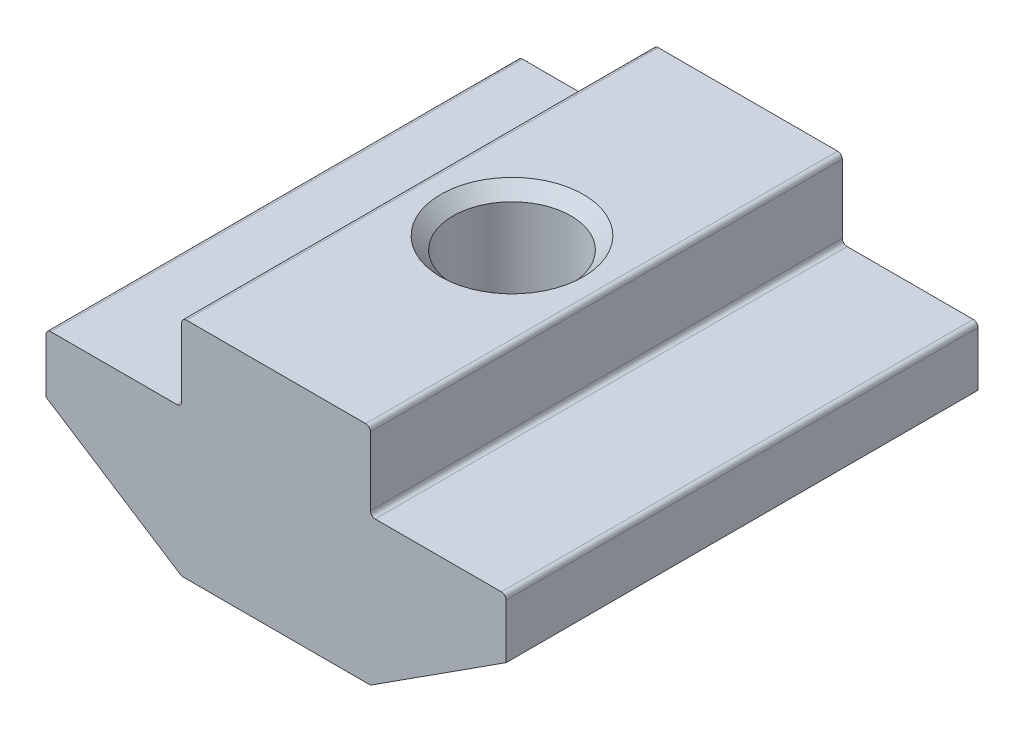
ISO-10303-21;
HEADER;
FILE_DESCRIPTION(('STEP AP214'),'2;1');
FILE_NAME('part.step','',(''),(''),'','','');
FILE_SCHEMA(('AUTOMOTIVE_DESIGN { 1 0 10303 214 1 1 1 1 }'));
ENDSEC;
DATA;
#1=APPLICATION_CONTEXT('core data for automotive mechanical design processes');
#2=APPLICATION_PROTOCOL_DEFINITION('international standard','automotive_design',2000,#1);
#3=PRODUCT_CONTEXT('',#1,'mechanical');
#4=PRODUCT('Part','Part','',(#3));
#5=PRODUCT_RELATED_PRODUCT_CATEGORY('part','',(#4));
#6=PRODUCT_DEFINITION_FORMATION('','',#4);
#7=PRODUCT_DEFINITION_CONTEXT('part definition',#1,'design');
#8=PRODUCT_DEFINITION('design','',#6,#7);
#9=PRODUCT_DEFINITION_SHAPE('','',#8);
#10=(LENGTH_UNIT() NAMED_UNIT(*) SI_UNIT(.MILLI.,.METRE.));
#11=(NAMED_UNIT(*) PLANE_ANGLE_UNIT() SI_UNIT($,.RADIAN.));
#12=(NAMED_UNIT(*) SI_UNIT($,.STERADIAN.) SOLID_ANGLE_UNIT());
#13=UNCERTAINTY_MEASURE_WITH_UNIT(LENGTH_MEASURE(1.E-05),#10,'distance_accuracy_value','');
#14=(GEOMETRIC_REPRESENTATION_CONTEXT(3) GLOBAL_UNCERTAINTY_ASSIGNED_CONTEXT((#13)) GLOBAL_UNIT_ASSIGNED_CONTEXT((#10,
#11,#12)) REPRESENTATION_CONTEXT('',''));
#15=CARTESIAN_POINT('',(0.,0.,0.));
#16=DIRECTION('',(0.,0.,1.));
#17=DIRECTION('',(1.,0.,0.));
#18=AXIS2_PLACEMENT_3D('',#15,#16,#17);
#19=CARTESIAN_POINT('',(-4.,0.,10.));
#20=DIRECTION('',(1.,0.,0.));
#21=DIRECTION('',(0.,0.,-1.));
#22=AXIS2_PLACEMENT_3D('',#19,#20,#21);
#23=PLANE('',#22);
#24=DIRECTION('',(0.,-1.,0.));
#25=VECTOR('',#24,1.);
#26=CARTESIAN_POINT('',(-4.,0.,10.));
#27=LINE('',#26,#25);
#28=CARTESIAN_POINT('',(-4.,-0.200000000000002,10.));
#29=VERTEX_POINT('',#28);
#30=CARTESIAN_POINT('',(-4.,-3.1,10.));
#31=VERTEX_POINT('',#30);
#32=EDGE_CURVE('E234',#29,#31,#27,.T.);
#33=ORIENTED_EDGE('',*,*,#32,.F.);
#34=DIRECTION('',(0.,0.,-1.));
#35=VECTOR('',#34,1.);
#36=CARTESIAN_POINT('',(-4.,-0.200000000000002,10.));
#37=LINE('',#36,#35);
#38=CARTESIAN_POINT('',(-4.,-0.200000000000002,-10.));
#39=VERTEX_POINT('',#38);
#40=EDGE_CURVE('E285',#29,#39,#37,.T.);
#41=ORIENTED_EDGE('',*,*,#40,.T.);
#42=DIRECTION('',(0.,-1.,0.));
#43=VECTOR('',#42,1.);
#44=CARTESIAN_POINT('',(-4.,0.,-10.));
#45=LINE('',#44,#43);
#46=CARTESIAN_POINT('',(-4.,-3.1,-10.));
#47=VERTEX_POINT('',#46);
#48=EDGE_CURVE('E208',#39,#47,#45,.T.);
#49=ORIENTED_EDGE('',*,*,#48,.T.);
#50=DIRECTION('',(0.,0.,-1.));
#51=VECTOR('',#50,1.);
#52=CARTESIAN_POINT('',(-4.,-3.1,10.));
#53=LINE('',#52,#51);
#54=EDGE_CURVE('E283',#47,#31,#53,.F.);
#55=ORIENTED_EDGE('',*,*,#54,.T.);
#56=EDGE_LOOP('',(#33,#41,#49,#55));
#57=FACE_BOUND('',#56,.T.);
#58=ADVANCED_FACE('F37',(#57),#23,.F.);
#59=CARTESIAN_POINT('',(-4.,-3.3,10.));
#60=DIRECTION('',(0.,-1.,0.));
#61=DIRECTION('',(1.,0.,0.));
#62=AXIS2_PLACEMENT_3D('',#59,#60,#61);
#63=PLANE('',#62);
#64=DIRECTION('',(-1.,0.,0.));
#65=VECTOR('',#64,1.);
#66=CARTESIAN_POINT('',(-4.,-3.3,-10.));
#67=LINE('',#66,#65);
#68=CARTESIAN_POINT('',(-4.2,-3.3,-10.));
#69=VERTEX_POINT('',#68);
#70=CARTESIAN_POINT('',(-9.55,-3.3,-10.));
#71=VERTEX_POINT('',#70);
#72=EDGE_CURVE('E211',#69,#71,#67,.T.);
#73=ORIENTED_EDGE('',*,*,#72,.T.);
#74=DIRECTION('',(0.,0.,-1.));
#75=VECTOR('',#74,1.);
#76=CARTESIAN_POINT('',(-9.55,-3.3,10.));
#77=LINE('',#76,#75);
#78=CARTESIAN_POINT('',(-9.55,-3.3,10.));
#79=VERTEX_POINT('',#78);
#80=EDGE_CURVE('E293',#71,#79,#77,.F.);
#81=ORIENTED_EDGE('',*,*,#80,.T.);
#82=DIRECTION('',(-1.,0.,0.));
#83=VECTOR('',#82,1.);
#84=CARTESIAN_POINT('',(-4.,-3.3,10.));
#85=LINE('',#84,#83);
#86=CARTESIAN_POINT('',(-4.2,-3.3,10.));
#87=VERTEX_POINT('',#86);
#88=EDGE_CURVE('E175',#87,#79,#85,.T.);
#89=ORIENTED_EDGE('',*,*,#88,.F.);
#90=DIRECTION('',(0.,0.,-1.));
#91=VECTOR('',#90,1.);
#92=CARTESIAN_POINT('',(-4.2,-3.3,-10.));
#93=LINE('',#92,#91);
#94=EDGE_CURVE('E290',#87,#69,#93,.T.);
#95=ORIENTED_EDGE('',*,*,#94,.T.);
#96=EDGE_LOOP('',(#73,#81,#89,#95));
#97=FACE_BOUND('',#96,.T.);
#98=ADVANCED_FACE('F313',(#97),#63,.F.);
#99=CARTESIAN_POINT('',(-9.75,-3.3,10.));
#100=DIRECTION('',(1.,0.,0.));
#101=DIRECTION('',(0.,0.,-1.));
#102=AXIS2_PLACEMENT_3D('',#99,#100,#101);
#103=PLANE('',#102);
#104=DIRECTION('',(0.,-1.,0.));
#105=VECTOR('',#104,1.);
#106=CARTESIAN_POINT('',(-9.75,-3.3,10.));
#107=LINE('',#106,#105);
#108=CARTESIAN_POINT('',(-9.75,-3.5,10.));
#109=VERTEX_POINT('',#108);
#110=CARTESIAN_POINT('',(-9.75,-5.8,10.));
#111=VERTEX_POINT('',#110);
#112=EDGE_CURVE('E162',#109,#111,#107,.T.);
#113=ORIENTED_EDGE('',*,*,#112,.F.);
#114=DIRECTION('',(0.,0.,-1.));
#115=VECTOR('',#114,1.);
#116=CARTESIAN_POINT('',(-9.75,-3.5,10.));
#117=LINE('',#116,#115);
#118=CARTESIAN_POINT('',(-9.75,-3.5,-10.));
#119=VERTEX_POINT('',#118);
#120=EDGE_CURVE('E288',#109,#119,#117,.T.);
#121=ORIENTED_EDGE('',*,*,#120,.T.);
#122=DIRECTION('',(0.,-1.,0.));
#123=VECTOR('',#122,1.);
#124=CARTESIAN_POINT('',(-9.75,-3.3,-10.));
#125=LINE('',#124,#123);
#126=CARTESIAN_POINT('',(-9.75,-5.8,-10.));
#127=VERTEX_POINT('',#126);
#128=EDGE_CURVE('E181',#119,#127,#125,.T.);
#129=ORIENTED_EDGE('',*,*,#128,.T.);
#130=DIRECTION('',(0.,0.,-1.));
#131=VECTOR('',#130,1.);
#132=CARTESIAN_POINT('',(-9.75,-5.8,10.));
#133=LINE('',#132,#131);
#134=EDGE_CURVE('E178',#111,#127,#133,.T.);
#135=ORIENTED_EDGE('',*,*,#134,.F.);
#136=EDGE_LOOP('',(#113,#121,#129,#135));
#137=FACE_BOUND('',#136,.T.);
#138=ADVANCED_FACE('F179',(#137),#103,.F.);
#139=CARTESIAN_POINT('',(-9.75,-5.8,10.));
#140=DIRECTION('',(0.541127125407786,0.840940802998586,0.));
#141=DIRECTION('',(-0.840940802998586,0.541127125407786,0.));
#142=AXIS2_PLACEMENT_3D('',#139,#140,#141);
#143=PLANE('',#142);
#144=DIRECTION('',(0.840940802998586,-0.541127125407786,0.));
#145=VECTOR('',#144,1.);
#146=CARTESIAN_POINT('',(-9.75,-5.8,-10.));
#147=LINE('',#146,#145);
#148=CARTESIAN_POINT('',(-4.04943731798692,-9.46818816059972,-10.));
#149=VERTEX_POINT('',#148);
#150=EDGE_CURVE('E216',#127,#149,#147,.T.);
#151=ORIENTED_EDGE('',*,*,#150,.T.);
#152=DIRECTION('',(0.,0.,-1.));
#153=VECTOR('',#152,1.);
#154=CARTESIAN_POINT('',(-4.04943731798692,-9.46818816059972,10.));
#155=LINE('',#154,#153);
#156=CARTESIAN_POINT('',(-4.04943731798692,-9.46818816059972,10.));
#157=VERTEX_POINT('',#156);
#158=EDGE_CURVE('E190',#149,#157,#155,.F.);
#159=ORIENTED_EDGE('',*,*,#158,.T.);
#160=DIRECTION('',(0.840940802998586,-0.541127125407786,0.));
#161=VECTOR('',#160,1.);
#162=CARTESIAN_POINT('',(-9.75,-5.8,10.));
#163=LINE('',#162,#161);
#164=EDGE_CURVE('E167',#111,#157,#163,.T.);
#165=ORIENTED_EDGE('',*,*,#164,.F.);
#166=ORIENTED_EDGE('',*,*,#134,.T.);
#167=EDGE_LOOP('',(#151,#159,#165,#166));
#168=FACE_BOUND('',#167,.T.);
#169=ADVANCED_FACE('F188',(#168),#143,.F.);
#170=CARTESIAN_POINT('',(-4.,-9.5,10.));
#171=DIRECTION('',(0.,1.,0.));
#172=DIRECTION('',(0.,0.,1.));
#173=AXIS2_PLACEMENT_3D('',#170,#171,#172);
#174=PLANE('',#173);
#175=CARTESIAN_POINT('',(0.,-9.5,0.));
#176=DIRECTION('',(0.,1.,0.));
#177=DIRECTION('',(0.,0.,1.));
#178=AXIS2_PLACEMENT_3D('',#175,#176,#177);
#179=CIRCLE('',#178,3.025);
#180=CARTESIAN_POINT('',(0.,-9.5,3.025));
#181=VERTEX_POINT('',#180);
#182=EDGE_CURVE('E325',#181,#181,#179,.T.);
#183=ORIENTED_EDGE('',*,*,#182,.T.);
#184=EDGE_LOOP('',(#183));
#185=FACE_BOUND('',#184,.T.);
#186=DIRECTION('',(1.,0.,0.));
#187=VECTOR('',#186,1.);
#188=CARTESIAN_POINT('',(-4.,-9.5,-10.));
#189=LINE('',#188,#187);
#190=CARTESIAN_POINT('',(-3.94121189290537,-9.5,-10.));
#191=VERTEX_POINT('',#190);
#192=CARTESIAN_POINT('',(3.94121189290537,-9.5,-10.));
#193=VERTEX_POINT('',#192);
#194=EDGE_CURVE('E218',#191,#193,#189,.T.);
#195=ORIENTED_EDGE('',*,*,#194,.T.);
#196=DIRECTION('',(0.,0.,-1.));
#197=VECTOR('',#196,1.);
#198=CARTESIAN_POINT('',(3.94121189290537,-9.5,10.));
#199=LINE('',#198,#197);
#200=CARTESIAN_POINT('',(3.94121189290537,-9.5,10.));
#201=VERTEX_POINT('',#200);
#202=EDGE_CURVE('E254',#193,#201,#199,.F.);
#203=ORIENTED_EDGE('',*,*,#202,.T.);
#204=DIRECTION('',(1.,0.,0.));
#205=VECTOR('',#204,1.);
#206=CARTESIAN_POINT('',(-4.,-9.5,10.));
#207=LINE('',#206,#205);
#208=CARTESIAN_POINT('',(-3.94121189290537,-9.5,10.));
#209=VERTEX_POINT('',#208);
#210=EDGE_CURVE('E191',#209,#201,#207,.T.);
#211=ORIENTED_EDGE('',*,*,#210,.F.);
#212=DIRECTION('',(0.,0.,-1.));
#213=VECTOR('',#212,1.);
#214=CARTESIAN_POINT('',(-3.94121189290537,-9.5,10.));
#215=LINE('',#214,#213);
#216=EDGE_CURVE('E251',#209,#191,#215,.T.);
#217=ORIENTED_EDGE('',*,*,#216,.T.);
#218=EDGE_LOOP('',(#195,#203,#211,#217));
#219=FACE_BOUND('',#218,.T.);
#220=ADVANCED_FACE('F329',(#185,#219),#174,.F.);
#221=CARTESIAN_POINT('',(9.75,-5.8,10.));
#222=DIRECTION('',(-0.541127125407786,0.840940802998586,0.));
#223=DIRECTION('',(-0.840940802998586,-0.541127125407786,0.));
#224=AXIS2_PLACEMENT_3D('',#221,#222,#223);
#225=PLANE('',#224);
#226=DIRECTION('',(0.840940802998586,0.541127125407786,0.));
#227=VECTOR('',#226,1.);
#228=CARTESIAN_POINT('',(9.75,-5.8,10.));
#229=LINE('',#228,#227);
#230=CARTESIAN_POINT('',(4.04943731798692,-9.46818816059972,10.));
#231=VERTEX_POINT('',#230);
#232=CARTESIAN_POINT('',(9.75,-5.8,10.));
#233=VERTEX_POINT('',#232);
#234=EDGE_CURVE('E193',#231,#233,#229,.T.);
#235=ORIENTED_EDGE('',*,*,#234,.F.);
#236=DIRECTION('',(0.,0.,-1.));
#237=VECTOR('',#236,1.);
#238=CARTESIAN_POINT('',(4.04943731798692,-9.46818816059972,10.));
#239=LINE('',#238,#237);
#240=CARTESIAN_POINT('',(4.04943731798692,-9.46818816059972,-10.));
#241=VERTEX_POINT('',#240);
#242=EDGE_CURVE('E185',#231,#241,#239,.T.);
#243=ORIENTED_EDGE('',*,*,#242,.T.);
#244=DIRECTION('',(0.840940802998586,0.541127125407786,0.));
#245=VECTOR('',#244,1.);
#246=CARTESIAN_POINT('',(9.75,-5.8,-10.));
#247=LINE('',#246,#245);
#248=CARTESIAN_POINT('',(9.75,-5.8,-10.));
#249=VERTEX_POINT('',#248);
#250=EDGE_CURVE('E221',#241,#249,#247,.T.);
#251=ORIENTED_EDGE('',*,*,#250,.T.);
#252=DIRECTION('',(0.,0.,-1.));
#253=VECTOR('',#252,1.);
#254=CARTESIAN_POINT('',(9.75,-5.8,10.));
#255=LINE('',#254,#253);
#256=EDGE_CURVE('E186',#233,#249,#255,.T.);
#257=ORIENTED_EDGE('',*,*,#256,.F.);
#258=EDGE_LOOP('',(#235,#243,#251,#257));
#259=FACE_BOUND('',#258,.T.);
#260=ADVANCED_FACE('F385',(#259),#225,.F.);
#261=CARTESIAN_POINT('',(9.75,-3.3,10.));
#262=DIRECTION('',(-1.,0.,0.));
#263=DIRECTION('',(0.,0.,1.));
#264=AXIS2_PLACEMENT_3D('',#261,#262,#263);
#265=PLANE('',#264);
#266=DIRECTION('',(0.,1.,0.));
#267=VECTOR('',#266,1.);
#268=CARTESIAN_POINT('',(9.75,-3.3,-10.));
#269=LINE('',#268,#267);
#270=CARTESIAN_POINT('',(9.75,-3.5,-10.));
#271=VERTEX_POINT('',#270);
#272=EDGE_CURVE('E223',#249,#271,#269,.T.);
#273=ORIENTED_EDGE('',*,*,#272,.T.);
#274=DIRECTION('',(0.,0.,-1.));
#275=VECTOR('',#274,1.);
#276=CARTESIAN_POINT('',(9.75,-3.5,10.));
#277=LINE('',#276,#275);
#278=CARTESIAN_POINT('',(9.75,-3.5,10.));
#279=VERTEX_POINT('',#278);
#280=EDGE_CURVE('E272',#271,#279,#277,.F.);
#281=ORIENTED_EDGE('',*,*,#280,.T.);
#282=DIRECTION('',(0.,1.,0.));
#283=VECTOR('',#282,1.);
#284=CARTESIAN_POINT('',(9.75,-3.3,10.));
#285=LINE('',#284,#283);
#286=EDGE_CURVE('E198',#233,#279,#285,.T.);
#287=ORIENTED_EDGE('',*,*,#286,.F.);
#288=ORIENTED_EDGE('',*,*,#256,.T.);
#289=EDGE_LOOP('',(#273,#281,#287,#288));
#290=FACE_BOUND('',#289,.T.);
#291=ADVANCED_FACE('F380',(#290),#265,.F.);
#292=CARTESIAN_POINT('',(4.,-3.3,10.));
#293=DIRECTION('',(0.,-1.,0.));
#294=DIRECTION('',(1.,0.,0.));
#295=AXIS2_PLACEMENT_3D('',#292,#293,#294);
#296=PLANE('',#295);
#297=DIRECTION('',(-1.,0.,0.));
#298=VECTOR('',#297,1.);
#299=CARTESIAN_POINT('',(4.,-3.3,10.));
#300=LINE('',#299,#298);
#301=CARTESIAN_POINT('',(9.55,-3.3,10.));
#302=VERTEX_POINT('',#301);
#303=CARTESIAN_POINT('',(4.2,-3.3,10.));
#304=VERTEX_POINT('',#303);
#305=EDGE_CURVE('E201',#302,#304,#300,.T.);
#306=ORIENTED_EDGE('',*,*,#305,.F.);
#307=DIRECTION('',(0.,0.,-1.));
#308=VECTOR('',#307,1.);
#309=CARTESIAN_POINT('',(9.55,-3.3,10.));
#310=LINE('',#309,#308);
#311=CARTESIAN_POINT('',(9.55,-3.3,-10.));
#312=VERTEX_POINT('',#311);
#313=EDGE_CURVE('E269',#302,#312,#310,.T.);
#314=ORIENTED_EDGE('',*,*,#313,.T.);
#315=DIRECTION('',(-1.,0.,0.));
#316=VECTOR('',#315,1.);
#317=CARTESIAN_POINT('',(4.,-3.3,-10.));
#318=LINE('',#317,#316);
#319=CARTESIAN_POINT('',(4.2,-3.3,-10.));
#320=VERTEX_POINT('',#319);
#321=EDGE_CURVE('E226',#312,#320,#318,.T.);
#322=ORIENTED_EDGE('',*,*,#321,.T.);
#323=DIRECTION('',(0.,0.,-1.));
#324=VECTOR('',#323,1.);
#325=CARTESIAN_POINT('',(4.2,-3.3,10.));
#326=LINE('',#325,#324);
#327=EDGE_CURVE('E267',#320,#304,#326,.F.);
#328=ORIENTED_EDGE('',*,*,#327,.T.);
#329=EDGE_LOOP('',(#306,#314,#322,#328));
#330=FACE_BOUND('',#329,.T.);
#331=ADVANCED_FACE('F372',(#330),#296,.F.);
#332=CARTESIAN_POINT('',(4.,0.,10.));
#333=DIRECTION('',(-1.,0.,0.));
#334=DIRECTION('',(0.,0.,1.));
#335=AXIS2_PLACEMENT_3D('',#332,#333,#334);
#336=PLANE('',#335);
#337=DIRECTION('',(0.,1.,0.));
#338=VECTOR('',#337,1.);
#339=CARTESIAN_POINT('',(4.,0.,10.));
#340=LINE('',#339,#338);
#341=CARTESIAN_POINT('',(4.,-3.1,10.));
#342=VERTEX_POINT('',#341);
#343=CARTESIAN_POINT('',(4.,-0.199999999999998,10.));
#344=VERTEX_POINT('',#343);
#345=EDGE_CURVE('E204',#342,#344,#340,.T.);
#346=ORIENTED_EDGE('',*,*,#345,.F.);
#347=DIRECTION('',(0.,0.,-1.));
#348=VECTOR('',#347,1.);
#349=CARTESIAN_POINT('',(4.,-3.1,-10.));
#350=LINE('',#349,#348);
#351=CARTESIAN_POINT('',(4.,-3.1,-10.));
#352=VERTEX_POINT('',#351);
#353=EDGE_CURVE('E276',#342,#352,#350,.T.);
#354=ORIENTED_EDGE('',*,*,#353,.T.);
#355=DIRECTION('',(0.,1.,0.));
#356=VECTOR('',#355,1.);
#357=CARTESIAN_POINT('',(4.,0.,-10.));
#358=LINE('',#357,#356);
#359=CARTESIAN_POINT('',(4.,-0.199999999999998,-10.));
#360=VERTEX_POINT('',#359);
#361=EDGE_CURVE('E229',#352,#360,#358,.T.);
#362=ORIENTED_EDGE('',*,*,#361,.T.);
#363=DIRECTION('',(0.,0.,-1.));
#364=VECTOR('',#363,1.);
#365=CARTESIAN_POINT('',(4.,-0.199999999999998,10.));
#366=LINE('',#365,#364);
#367=EDGE_CURVE('E274',#360,#344,#366,.F.);
#368=ORIENTED_EDGE('',*,*,#367,.T.);
#369=EDGE_LOOP('',(#346,#354,#362,#368));
#370=FACE_BOUND('',#369,.T.);
#371=ADVANCED_FACE('F353',(#370),#336,.F.);
#372=CARTESIAN_POINT('',(4.,0.,10.));
#373=DIRECTION('',(0.,-1.,0.));
#374=DIRECTION('',(1.,0.,0.));
#375=AXIS2_PLACEMENT_3D('',#372,#373,#374);
#376=PLANE('',#375);
#377=CARTESIAN_POINT('',(0.,0.,0.));
#378=DIRECTION('',(0.,1.,0.));
#379=DIRECTION('',(0.,0.,1.));
#380=AXIS2_PLACEMENT_3D('',#377,#378,#379);
#381=CIRCLE('',#380,3.025);
#382=CARTESIAN_POINT('',(0.,0.,3.025));
#383=VERTEX_POINT('',#382);
#384=EDGE_CURVE('E322',#383,#383,#381,.T.);
#385=ORIENTED_EDGE('',*,*,#384,.F.);
#386=EDGE_LOOP('',(#385));
#387=FACE_BOUND('',#386,.T.);
#388=DIRECTION('',(-1.,0.,0.));
#389=VECTOR('',#388,1.);
#390=CARTESIAN_POINT('',(4.,0.,10.));
#391=LINE('',#390,#389);
#392=CARTESIAN_POINT('',(3.8,0.,10.));
#393=VERTEX_POINT('',#392);
#394=CARTESIAN_POINT('',(-3.8,0.,10.));
#395=VERTEX_POINT('',#394);
#396=EDGE_CURVE('E206',#393,#395,#391,.T.);
#397=ORIENTED_EDGE('',*,*,#396,.F.);
#398=DIRECTION('',(0.,0.,-1.));
#399=VECTOR('',#398,1.);
#400=CARTESIAN_POINT('',(3.8,0.,10.));
#401=LINE('',#400,#399);
#402=CARTESIAN_POINT('',(3.8,0.,-10.));
#403=VERTEX_POINT('',#402);
#404=EDGE_CURVE('E280',#393,#403,#401,.T.);
#405=ORIENTED_EDGE('',*,*,#404,.T.);
#406=DIRECTION('',(-1.,0.,0.));
#407=VECTOR('',#406,1.);
#408=CARTESIAN_POINT('',(4.,0.,-10.));
#409=LINE('',#408,#407);
#410=CARTESIAN_POINT('',(-3.8,0.,-10.));
#411=VERTEX_POINT('',#410);
#412=EDGE_CURVE('E232',#403,#411,#409,.T.);
#413=ORIENTED_EDGE('',*,*,#412,.T.);
#414=DIRECTION('',(0.,0.,-1.));
#415=VECTOR('',#414,1.);
#416=CARTESIAN_POINT('',(-3.8,0.,10.));
#417=LINE('',#416,#415);
#418=EDGE_CURVE('E52',#411,#395,#417,.F.);
#419=ORIENTED_EDGE('',*,*,#418,.T.);
#420=EDGE_LOOP('',(#397,#405,#413,#419));
#421=FACE_BOUND('',#420,.T.);
#422=ADVANCED_FACE('F351',(#387,#421),#376,.F.);
#423=CARTESIAN_POINT('',(0.,0.,10.));
#424=DIRECTION('',(0.,0.,-1.));
#425=DIRECTION('',(-1.,0.,0.));
#426=AXIS2_PLACEMENT_3D('',#423,#424,#425);
#427=PLANE('',#426);
#428=ORIENTED_EDGE('',*,*,#210,.T.);
#429=CARTESIAN_POINT('',(3.94121189290537,-9.3,10.));
#430=DIRECTION('',(0.,0.,-1.));
#431=DIRECTION('',(-1.,0.,0.));
#432=AXIS2_PLACEMENT_3D('',#429,#430,#431);
#433=CIRCLE('',#432,0.2);
#434=EDGE_CURVE('E264',#201,#231,#433,.F.);
#435=ORIENTED_EDGE('',*,*,#434,.T.);
#436=ORIENTED_EDGE('',*,*,#234,.T.);
#437=ORIENTED_EDGE('',*,*,#286,.T.);
#438=CARTESIAN_POINT('',(9.55,-3.5,10.));
#439=DIRECTION('',(0.,0.,-1.));
#440=DIRECTION('',(-1.,0.,0.));
#441=AXIS2_PLACEMENT_3D('',#438,#439,#440);
#442=CIRCLE('',#441,0.2);
#443=EDGE_CURVE('E260',#279,#302,#442,.F.);
#444=ORIENTED_EDGE('',*,*,#443,.T.);
#445=ORIENTED_EDGE('',*,*,#305,.T.);
#446=CARTESIAN_POINT('',(4.2,-3.1,10.));
#447=DIRECTION('',(0.,0.,-1.));
#448=DIRECTION('',(-1.,0.,0.));
#449=AXIS2_PLACEMENT_3D('',#446,#447,#448);
#450=CIRCLE('',#449,0.2);
#451=EDGE_CURVE('E297',#304,#342,#450,.T.);
#452=ORIENTED_EDGE('',*,*,#451,.T.);
#453=ORIENTED_EDGE('',*,*,#345,.T.);
#454=CARTESIAN_POINT('',(3.8,-0.199999999999998,10.));
#455=DIRECTION('',(0.,0.,-1.));
#456=DIRECTION('',(-1.,0.,0.));
#457=AXIS2_PLACEMENT_3D('',#454,#455,#456);
#458=CIRCLE('',#457,0.2);
#459=EDGE_CURVE('E59',#344,#393,#458,.F.);
#460=ORIENTED_EDGE('',*,*,#459,.T.);
#461=ORIENTED_EDGE('',*,*,#396,.T.);
#462=CARTESIAN_POINT('',(-3.8,-0.200000000000002,10.));
#463=DIRECTION('',(0.,0.,-1.));
#464=DIRECTION('',(-1.,0.,0.));
#465=AXIS2_PLACEMENT_3D('',#462,#463,#464);
#466=CIRCLE('',#465,0.2);
#467=EDGE_CURVE('E257',#395,#29,#466,.F.);
#468=ORIENTED_EDGE('',*,*,#467,.T.);
#469=ORIENTED_EDGE('',*,*,#32,.T.);
#470=CARTESIAN_POINT('',(-4.2,-3.1,10.));
#471=DIRECTION('',(0.,0.,-1.));
#472=DIRECTION('',(-1.,0.,0.));
#473=AXIS2_PLACEMENT_3D('',#470,#471,#472);
#474=CIRCLE('',#473,0.2);
#475=EDGE_CURVE('E11',#31,#87,#474,.T.);
#476=ORIENTED_EDGE('',*,*,#475,.T.);
#477=ORIENTED_EDGE('',*,*,#88,.T.);
#478=CARTESIAN_POINT('',(-9.55,-3.5,10.));
#479=DIRECTION('',(0.,0.,-1.));
#480=DIRECTION('',(-1.,0.,0.));
#481=AXIS2_PLACEMENT_3D('',#478,#479,#480);
#482=CIRCLE('',#481,0.2);
#483=EDGE_CURVE('E171',#79,#109,#482,.F.);
#484=ORIENTED_EDGE('',*,*,#483,.T.);
#485=ORIENTED_EDGE('',*,*,#112,.T.);
#486=ORIENTED_EDGE('',*,*,#164,.T.);
#487=CARTESIAN_POINT('',(-3.94121189290537,-9.3,10.));
#488=DIRECTION('',(0.,0.,-1.));
#489=DIRECTION('',(-1.,0.,0.));
#490=AXIS2_PLACEMENT_3D('',#487,#488,#489);
#491=CIRCLE('',#490,0.2);
#492=EDGE_CURVE('E262',#157,#209,#491,.F.);
#493=ORIENTED_EDGE('',*,*,#492,.T.);
#494=EDGE_LOOP('',(#428,#435,#436,#437,#444,#445,#452,#453,#460,#461,#468,#469,#476,#477,#484,
#485,#486,#493));
#495=FACE_BOUND('',#494,.T.);
#496=ADVANCED_FACE('F165',(#495),#427,.F.);
#497=CARTESIAN_POINT('',(0.,0.,-10.));
#498=DIRECTION('',(0.,0.,-1.));
#499=DIRECTION('',(-1.,0.,0.));
#500=AXIS2_PLACEMENT_3D('',#497,#498,#499);
#501=PLANE('',#500);
#502=ORIENTED_EDGE('',*,*,#250,.F.);
#503=CARTESIAN_POINT('',(3.94121189290537,-9.3,-10.));
#504=DIRECTION('',(0.,0.,-1.));
#505=DIRECTION('',(-1.,0.,0.));
#506=AXIS2_PLACEMENT_3D('',#503,#504,#505);
#507=CIRCLE('',#506,0.2);
#508=EDGE_CURVE('E249',#241,#193,#507,.T.);
#509=ORIENTED_EDGE('',*,*,#508,.T.);
#510=ORIENTED_EDGE('',*,*,#194,.F.);
#511=CARTESIAN_POINT('',(-3.94121189290537,-9.3,-10.));
#512=DIRECTION('',(0.,0.,-1.));
#513=DIRECTION('',(-1.,0.,0.));
#514=AXIS2_PLACEMENT_3D('',#511,#512,#513);
#515=CIRCLE('',#514,0.2);
#516=EDGE_CURVE('E247',#191,#149,#515,.T.);
#517=ORIENTED_EDGE('',*,*,#516,.T.);
#518=ORIENTED_EDGE('',*,*,#150,.F.);
#519=ORIENTED_EDGE('',*,*,#128,.F.);
#520=CARTESIAN_POINT('',(-9.55,-3.5,-10.));
#521=DIRECTION('',(0.,0.,-1.));
#522=DIRECTION('',(-1.,0.,0.));
#523=AXIS2_PLACEMENT_3D('',#520,#521,#522);
#524=CIRCLE('',#523,0.2);
#525=EDGE_CURVE('E239',#119,#71,#524,.T.);
#526=ORIENTED_EDGE('',*,*,#525,.T.);
#527=ORIENTED_EDGE('',*,*,#72,.F.);
#528=CARTESIAN_POINT('',(-4.2,-3.1,-10.));
#529=DIRECTION('',(0.,0.,-1.));
#530=DIRECTION('',(-1.,0.,0.));
#531=AXIS2_PLACEMENT_3D('',#528,#529,#530);
#532=CIRCLE('',#531,0.2);
#533=EDGE_CURVE('E45',#69,#47,#532,.F.);
#534=ORIENTED_EDGE('',*,*,#533,.T.);
#535=ORIENTED_EDGE('',*,*,#48,.F.);
#536=CARTESIAN_POINT('',(-3.8,-0.200000000000002,-10.));
#537=DIRECTION('',(0.,0.,-1.));
#538=DIRECTION('',(-1.,0.,0.));
#539=AXIS2_PLACEMENT_3D('',#536,#537,#538);
#540=CIRCLE('',#539,0.2);
#541=EDGE_CURVE('E241',#39,#411,#540,.T.);
#542=ORIENTED_EDGE('',*,*,#541,.T.);
#543=ORIENTED_EDGE('',*,*,#412,.F.);
#544=CARTESIAN_POINT('',(3.8,-0.199999999999998,-10.));
#545=DIRECTION('',(0.,0.,-1.));
#546=DIRECTION('',(-1.,0.,0.));
#547=AXIS2_PLACEMENT_3D('',#544,#545,#546);
#548=CIRCLE('',#547,0.2);
#549=EDGE_CURVE('E243',#403,#360,#548,.T.);
#550=ORIENTED_EDGE('',*,*,#549,.T.);
#551=ORIENTED_EDGE('',*,*,#361,.F.);
#552=CARTESIAN_POINT('',(4.2,-3.1,-10.));
#553=DIRECTION('',(0.,0.,-1.));
#554=DIRECTION('',(-1.,0.,0.));
#555=AXIS2_PLACEMENT_3D('',#552,#553,#554);
#556=CIRCLE('',#555,0.2);
#557=EDGE_CURVE('E295',#352,#320,#556,.F.);
#558=ORIENTED_EDGE('',*,*,#557,.T.);
#559=ORIENTED_EDGE('',*,*,#321,.F.);
#560=CARTESIAN_POINT('',(9.55,-3.5,-10.));
#561=DIRECTION('',(0.,0.,-1.));
#562=DIRECTION('',(-1.,0.,0.));
#563=AXIS2_PLACEMENT_3D('',#560,#561,#562);
#564=CIRCLE('',#563,0.2);
#565=EDGE_CURVE('E245',#312,#271,#564,.T.);
#566=ORIENTED_EDGE('',*,*,#565,.T.);
#567=ORIENTED_EDGE('',*,*,#272,.F.);
#568=EDGE_LOOP('',(#502,#509,#510,#517,#518,#519,#526,#527,#534,#535,#542,#543,#550,#551,#558,
#559,#566,#567));
#569=FACE_BOUND('',#568,.T.);
#570=ADVANCED_FACE('F302',(#569),#501,.T.);
#571=CARTESIAN_POINT('',(0.,-8.975,0.));
#572=DIRECTION('',(0.,-1.,0.));
#573=DIRECTION('',(0.,0.,-1.));
#574=AXIS2_PLACEMENT_3D('',#571,#572,#573);
#575=CONICAL_SURFACE('',#574,2.5,0.785398163397447);
#576=ORIENTED_EDGE('',*,*,#182,.F.);
#577=EDGE_LOOP('',(#576));
#578=FACE_BOUND('',#577,.T.);
#579=CARTESIAN_POINT('',(0.,-8.975,0.));
#580=DIRECTION('',(0.,1.,0.));
#581=DIRECTION('',(0.,0.,1.));
#582=AXIS2_PLACEMENT_3D('',#579,#580,#581);
#583=CIRCLE('',#582,2.5);
#584=CARTESIAN_POINT('',(0.,-8.975,2.5));
#585=VERTEX_POINT('',#584);
#586=EDGE_CURVE('E212',#585,#585,#583,.T.);
#587=ORIENTED_EDGE('',*,*,#586,.T.);
#588=EDGE_LOOP('',(#587));
#589=FACE_BOUND('',#588,.T.);
#590=ADVANCED_FACE('F332',(#578,#589),#575,.F.);
#591=CARTESIAN_POINT('',(0.,0.,0.));
#592=DIRECTION('',(0.,1.,0.));
#593=DIRECTION('',(0.,0.,1.));
#594=AXIS2_PLACEMENT_3D('',#591,#592,#593);
#595=CYLINDRICAL_SURFACE('',#594,2.5);
#596=ORIENTED_EDGE('',*,*,#586,.F.);
#597=EDGE_LOOP('',(#596));
#598=FACE_BOUND('',#597,.T.);
#599=CARTESIAN_POINT('',(0.,-0.524999999999999,0.));
#600=DIRECTION('',(0.,1.,0.));
#601=DIRECTION('',(0.,0.,1.));
#602=AXIS2_PLACEMENT_3D('',#599,#600,#601);
#603=CIRCLE('',#602,2.5);
#604=CARTESIAN_POINT('',(0.,-0.524999999999999,2.5));
#605=VERTEX_POINT('',#604);
#606=EDGE_CURVE('E319',#605,#605,#603,.T.);
#607=ORIENTED_EDGE('',*,*,#606,.T.);
#608=EDGE_LOOP('',(#607));
#609=FACE_BOUND('',#608,.T.);
#610=ADVANCED_FACE('F335',(#598,#609),#595,.F.);
#611=CARTESIAN_POINT('',(0.,0.,0.));
#612=DIRECTION('',(0.,1.,0.));
#613=DIRECTION('',(0.,0.,1.));
#614=AXIS2_PLACEMENT_3D('',#611,#612,#613);
#615=CONICAL_SURFACE('',#614,3.025,0.78539816339745);
#616=ORIENTED_EDGE('',*,*,#606,.F.);
#617=EDGE_LOOP('',(#616));
#618=FACE_BOUND('',#617,.T.);
#619=ORIENTED_EDGE('',*,*,#384,.T.);
#620=EDGE_LOOP('',(#619));
#621=FACE_BOUND('',#620,.T.);
#622=ADVANCED_FACE('F341',(#618,#621),#615,.F.);
#623=CARTESIAN_POINT('',(3.94121189290537,-9.3,10.));
#624=DIRECTION('',(0.,0.,-1.));
#625=DIRECTION('',(-1.,0.,0.));
#626=AXIS2_PLACEMENT_3D('',#623,#624,#625);
#627=CYLINDRICAL_SURFACE('',#626,0.2);
#628=ORIENTED_EDGE('',*,*,#434,.F.);
#629=ORIENTED_EDGE('',*,*,#202,.F.);
#630=ORIENTED_EDGE('',*,*,#508,.F.);
#631=ORIENTED_EDGE('',*,*,#242,.F.);
#632=EDGE_LOOP('',(#628,#629,#630,#631));
#633=FACE_BOUND('',#632,.T.);
#634=ADVANCED_FACE('F347',(#633),#627,.T.);
#635=CARTESIAN_POINT('',(-3.94121189290537,-9.3,10.));
#636=DIRECTION('',(0.,0.,-1.));
#637=DIRECTION('',(-1.,0.,0.));
#638=AXIS2_PLACEMENT_3D('',#635,#636,#637);
#639=CYLINDRICAL_SURFACE('',#638,0.2);
#640=ORIENTED_EDGE('',*,*,#492,.F.);
#641=ORIENTED_EDGE('',*,*,#158,.F.);
#642=ORIENTED_EDGE('',*,*,#516,.F.);
#643=ORIENTED_EDGE('',*,*,#216,.F.);
#644=EDGE_LOOP('',(#640,#641,#642,#643));
#645=FACE_BOUND('',#644,.T.);
#646=ADVANCED_FACE('F394',(#645),#639,.T.);
#647=CARTESIAN_POINT('',(9.55,-3.5,10.));
#648=DIRECTION('',(0.,0.,-1.));
#649=DIRECTION('',(-1.,0.,0.));
#650=AXIS2_PLACEMENT_3D('',#647,#648,#649);
#651=CYLINDRICAL_SURFACE('',#650,0.2);
#652=ORIENTED_EDGE('',*,*,#443,.F.);
#653=ORIENTED_EDGE('',*,*,#280,.F.);
#654=ORIENTED_EDGE('',*,*,#565,.F.);
#655=ORIENTED_EDGE('',*,*,#313,.F.);
#656=EDGE_LOOP('',(#652,#653,#654,#655));
#657=FACE_BOUND('',#656,.T.);
#658=ADVANCED_FACE('F376',(#657),#651,.T.);
#659=CARTESIAN_POINT('',(4.2,-3.1,10.));
#660=DIRECTION('',(0.,0.,1.));
#661=DIRECTION('',(1.,0.,0.));
#662=AXIS2_PLACEMENT_3D('',#659,#660,#661);
#663=CYLINDRICAL_SURFACE('',#662,0.2);
#664=ORIENTED_EDGE('',*,*,#451,.F.);
#665=ORIENTED_EDGE('',*,*,#327,.F.);
#666=ORIENTED_EDGE('',*,*,#557,.F.);
#667=ORIENTED_EDGE('',*,*,#353,.F.);
#668=EDGE_LOOP('',(#664,#665,#666,#667));
#669=FACE_BOUND('',#668,.T.);
#670=ADVANCED_FACE('F367',(#669),#663,.F.);
#671=CARTESIAN_POINT('',(3.8,-0.199999999999998,10.));
#672=DIRECTION('',(0.,0.,-1.));
#673=DIRECTION('',(-1.,0.,0.));
#674=AXIS2_PLACEMENT_3D('',#671,#672,#673);
#675=CYLINDRICAL_SURFACE('',#674,0.2);
#676=ORIENTED_EDGE('',*,*,#459,.F.);
#677=ORIENTED_EDGE('',*,*,#367,.F.);
#678=ORIENTED_EDGE('',*,*,#549,.F.);
#679=ORIENTED_EDGE('',*,*,#404,.F.);
#680=EDGE_LOOP('',(#676,#677,#678,#679));
#681=FACE_BOUND('',#680,.T.);
#682=ADVANCED_FACE('F359',(#681),#675,.T.);
#683=CARTESIAN_POINT('',(-3.8,-0.200000000000002,10.));
#684=DIRECTION('',(0.,0.,-1.));
#685=DIRECTION('',(-1.,0.,0.));
#686=AXIS2_PLACEMENT_3D('',#683,#684,#685);
#687=CYLINDRICAL_SURFACE('',#686,0.2);
#688=ORIENTED_EDGE('',*,*,#467,.F.);
#689=ORIENTED_EDGE('',*,*,#418,.F.);
#690=ORIENTED_EDGE('',*,*,#541,.F.);
#691=ORIENTED_EDGE('',*,*,#40,.F.);
#692=EDGE_LOOP('',(#688,#689,#690,#691));
#693=FACE_BOUND('',#692,.T.);
#694=ADVANCED_FACE('F398',(#693),#687,.T.);
#695=CARTESIAN_POINT('',(-9.55,-3.5,10.));
#696=DIRECTION('',(0.,0.,-1.));
#697=DIRECTION('',(-1.,0.,0.));
#698=AXIS2_PLACEMENT_3D('',#695,#696,#697);
#699=CYLINDRICAL_SURFACE('',#698,0.2);
#700=ORIENTED_EDGE('',*,*,#483,.F.);
#701=ORIENTED_EDGE('',*,*,#80,.F.);
#702=ORIENTED_EDGE('',*,*,#525,.F.);
#703=ORIENTED_EDGE('',*,*,#120,.F.);
#704=EDGE_LOOP('',(#700,#701,#702,#703));
#705=FACE_BOUND('',#704,.T.);
#706=ADVANCED_FACE('F396',(#705),#699,.T.);
#707=CARTESIAN_POINT('',(-4.2,-3.1,10.));
#708=DIRECTION('',(0.,0.,1.));
#709=DIRECTION('',(1.,0.,0.));
#710=AXIS2_PLACEMENT_3D('',#707,#708,#709);
#711=CYLINDRICAL_SURFACE('',#710,0.2);
#712=ORIENTED_EDGE('',*,*,#475,.F.);
#713=ORIENTED_EDGE('',*,*,#54,.F.);
#714=ORIENTED_EDGE('',*,*,#533,.F.);
#715=ORIENTED_EDGE('',*,*,#94,.F.);
#716=EDGE_LOOP('',(#712,#713,#714,#715));
#717=FACE_BOUND('',#716,.T.);
#718=ADVANCED_FACE('F39',(#717),#711,.F.);
#719=CLOSED_SHELL('',(#58,#98,#138,#169,#220,#260,#291,#331,#371,#422,#496,#570,#590,#610,#622,
#634,#646,#658,#670,#682,#694,#706,#718));
#720=MANIFOLD_SOLID_BREP('B2',#719);
#721=ADVANCED_BREP_SHAPE_REPRESENTATION('',(#18,#720),#14);
#722=SHAPE_DEFINITION_REPRESENTATION(#9,#721);
ENDSEC;
END-ISO-10303-21;
